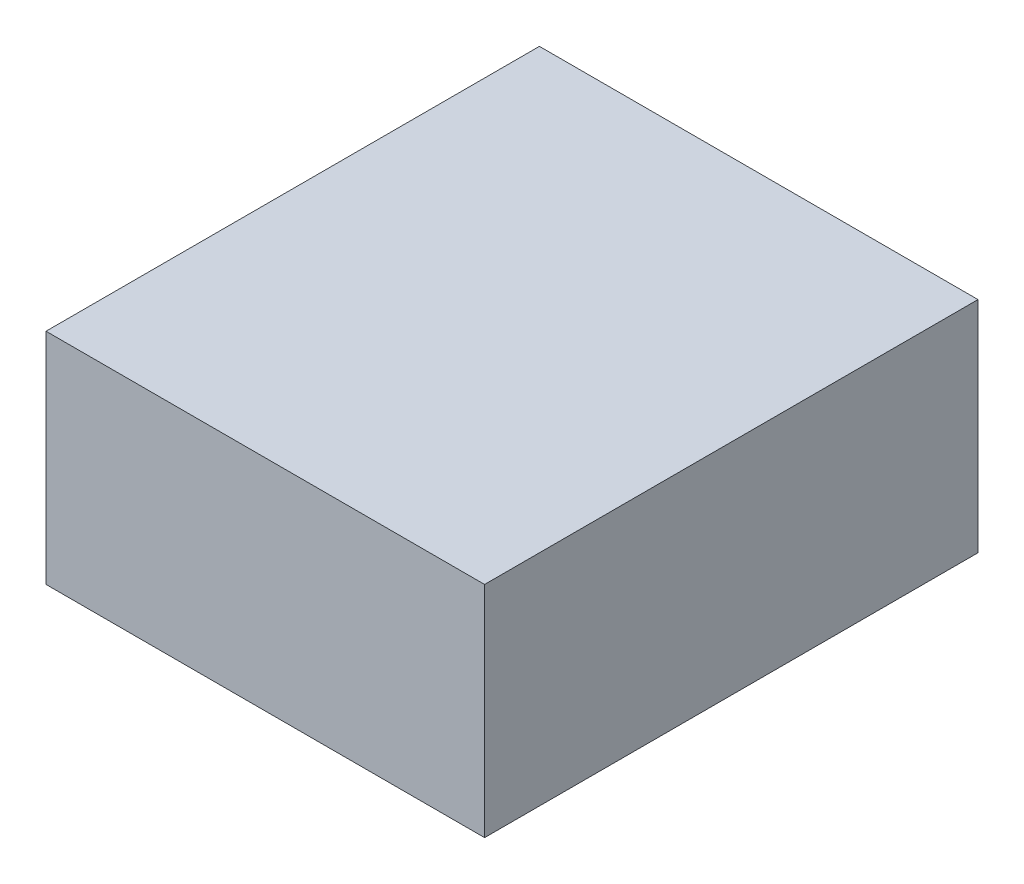
ISO-10303-21;
HEADER;
FILE_DESCRIPTION(('STEP AP214'),'2;1');
FILE_NAME('part.step','',(''),(''),'','','');
FILE_SCHEMA(('AUTOMOTIVE_DESIGN { 1 0 10303 214 1 1 1 1 }'));
ENDSEC;
DATA;
#1=APPLICATION_CONTEXT('core data for automotive mechanical design processes');
#2=APPLICATION_PROTOCOL_DEFINITION('international standard','automotive_design',2000,#1);
#3=PRODUCT_CONTEXT('',#1,'mechanical');
#4=PRODUCT('Part','Part','',(#3));
#5=PRODUCT_RELATED_PRODUCT_CATEGORY('part','',(#4));
#6=PRODUCT_DEFINITION_FORMATION('','',#4);
#7=PRODUCT_DEFINITION_CONTEXT('part definition',#1,'design');
#8=PRODUCT_DEFINITION('design','',#6,#7);
#9=PRODUCT_DEFINITION_SHAPE('','',#8);
#10=(LENGTH_UNIT() NAMED_UNIT(*) SI_UNIT(.MILLI.,.METRE.));
#11=(NAMED_UNIT(*) PLANE_ANGLE_UNIT() SI_UNIT($,.RADIAN.));
#12=(NAMED_UNIT(*) SI_UNIT($,.STERADIAN.) SOLID_ANGLE_UNIT());
#13=UNCERTAINTY_MEASURE_WITH_UNIT(LENGTH_MEASURE(1.E-05),#10,'distance_accuracy_value','');
#14=(GEOMETRIC_REPRESENTATION_CONTEXT(3) GLOBAL_UNCERTAINTY_ASSIGNED_CONTEXT((#13)) GLOBAL_UNIT_ASSIGNED_CONTEXT((#10,
#11,#12)) REPRESENTATION_CONTEXT('',''));
#15=CARTESIAN_POINT('',(0.,0.,0.));
#16=DIRECTION('',(0.,0.,1.));
#17=DIRECTION('',(1.,0.,0.));
#18=AXIS2_PLACEMENT_3D('',#15,#16,#17);
#19=CARTESIAN_POINT('',(0.3999992,0.1999996,0.));
#20=DIRECTION('',(0.,-1.,0.));
#21=DIRECTION('',(0.,0.,-1.));
#22=AXIS2_PLACEMENT_3D('',#19,#20,#21);
#23=PLANE('',#22);
#24=DIRECTION('',(0.,0.,-1.));
#25=VECTOR('',#24,1.);
#26=CARTESIAN_POINT('',(-0.3999992,0.1999996,0.));
#27=LINE('',#26,#25);
#28=CARTESIAN_POINT('',(-0.3999992,0.1999996,0.));
#29=VERTEX_POINT('',#28);
#30=CARTESIAN_POINT('',(-0.3999992,0.1999996,0.90000074));
#31=VERTEX_POINT('',#30);
#32=EDGE_CURVE('E20',#29,#31,#27,.F.);
#33=ORIENTED_EDGE('',*,*,#32,.T.);
#34=DIRECTION('',(-1.,0.,0.));
#35=VECTOR('',#34,1.);
#36=CARTESIAN_POINT('',(-0.3999992,0.1999996,0.90000074));
#37=LINE('',#36,#35);
#38=CARTESIAN_POINT('',(0.3999992,0.1999996,0.90000074));
#39=VERTEX_POINT('',#38);
#40=EDGE_CURVE('E55',#31,#39,#37,.F.);
#41=ORIENTED_EDGE('',*,*,#40,.T.);
#42=DIRECTION('',(0.,0.,1.));
#43=VECTOR('',#42,1.);
#44=CARTESIAN_POINT('',(0.3999992,0.1999996,0.));
#45=LINE('',#44,#43);
#46=CARTESIAN_POINT('',(0.3999992,0.1999996,0.));
#47=VERTEX_POINT('',#46);
#48=EDGE_CURVE('E76',#39,#47,#45,.F.);
#49=ORIENTED_EDGE('',*,*,#48,.T.);
#50=DIRECTION('',(-1.,0.,0.));
#51=VECTOR('',#50,1.);
#52=CARTESIAN_POINT('',(-0.3999992,0.1999996,0.));
#53=LINE('',#52,#51);
#54=EDGE_CURVE('E58',#29,#47,#53,.F.);
#55=ORIENTED_EDGE('',*,*,#54,.F.);
#56=EDGE_LOOP('',(#33,#41,#49,#55));
#57=FACE_BOUND('',#56,.T.);
#58=ADVANCED_FACE('F17',(#57),#23,.F.);
#59=CARTESIAN_POINT('',(-0.3999992,0.1999996,0.));
#60=DIRECTION('',(1.,0.,0.));
#61=DIRECTION('',(0.,0.,-1.));
#62=AXIS2_PLACEMENT_3D('',#59,#60,#61);
#63=PLANE('',#62);
#64=DIRECTION('',(0.,0.,1.));
#65=VECTOR('',#64,1.);
#66=CARTESIAN_POINT('',(-0.3999992,-0.1999996,0.));
#67=LINE('',#66,#65);
#68=CARTESIAN_POINT('',(-0.3999992,-0.1999996,0.));
#69=VERTEX_POINT('',#68);
#70=CARTESIAN_POINT('',(-0.3999992,-0.1999996,0.90000074));
#71=VERTEX_POINT('',#70);
#72=EDGE_CURVE('E73',#69,#71,#67,.T.);
#73=ORIENTED_EDGE('',*,*,#72,.T.);
#74=DIRECTION('',(0.,1.,0.));
#75=VECTOR('',#74,1.);
#76=CARTESIAN_POINT('',(-0.3999992,-0.1999996,0.90000074));
#77=LINE('',#76,#75);
#78=EDGE_CURVE('E63',#71,#31,#77,.T.);
#79=ORIENTED_EDGE('',*,*,#78,.T.);
#80=ORIENTED_EDGE('',*,*,#32,.F.);
#81=DIRECTION('',(0.,1.,0.));
#82=VECTOR('',#81,1.);
#83=CARTESIAN_POINT('',(-0.3999992,-0.1999996,0.));
#84=LINE('',#83,#82);
#85=EDGE_CURVE('E78',#69,#29,#84,.T.);
#86=ORIENTED_EDGE('',*,*,#85,.F.);
#87=EDGE_LOOP('',(#73,#79,#80,#86));
#88=FACE_BOUND('',#87,.T.);
#89=ADVANCED_FACE('F72',(#88),#63,.F.);
#90=CARTESIAN_POINT('',(-0.3999992,-0.1999996,0.90000074));
#91=DIRECTION('',(0.,0.,-1.));
#92=DIRECTION('',(-1.,0.,0.));
#93=AXIS2_PLACEMENT_3D('',#90,#91,#92);
#94=PLANE('',#93);
#95=DIRECTION('',(0.,1.,0.));
#96=VECTOR('',#95,1.);
#97=CARTESIAN_POINT('',(0.3999992,-0.1999996,0.90000074));
#98=LINE('',#97,#96);
#99=CARTESIAN_POINT('',(0.3999992,-0.1999996,0.90000074));
#100=VERTEX_POINT('',#99);
#101=EDGE_CURVE('E69',#100,#39,#98,.T.);
#102=ORIENTED_EDGE('',*,*,#101,.T.);
#103=ORIENTED_EDGE('',*,*,#40,.F.);
#104=ORIENTED_EDGE('',*,*,#78,.F.);
#105=DIRECTION('',(1.,0.,0.));
#106=VECTOR('',#105,1.);
#107=CARTESIAN_POINT('',(-0.3999992,-0.1999996,0.90000074));
#108=LINE('',#107,#106);
#109=EDGE_CURVE('E83',#71,#100,#108,.T.);
#110=ORIENTED_EDGE('',*,*,#109,.T.);
#111=EDGE_LOOP('',(#102,#103,#104,#110));
#112=FACE_BOUND('',#111,.T.);
#113=ADVANCED_FACE('F66',(#112),#94,.F.);
#114=CARTESIAN_POINT('',(0.3999992,-0.1999996,0.));
#115=DIRECTION('',(-1.,0.,0.));
#116=DIRECTION('',(0.,0.,1.));
#117=AXIS2_PLACEMENT_3D('',#114,#115,#116);
#118=PLANE('',#117);
#119=ORIENTED_EDGE('',*,*,#48,.F.);
#120=ORIENTED_EDGE('',*,*,#101,.F.);
#121=DIRECTION('',(0.,0.,1.));
#122=VECTOR('',#121,1.);
#123=CARTESIAN_POINT('',(0.3999992,-0.1999996,0.));
#124=LINE('',#123,#122);
#125=CARTESIAN_POINT('',(0.3999992,-0.1999996,0.));
#126=VERTEX_POINT('',#125);
#127=EDGE_CURVE('E26',#100,#126,#124,.F.);
#128=ORIENTED_EDGE('',*,*,#127,.T.);
#129=DIRECTION('',(0.,1.,0.));
#130=VECTOR('',#129,1.);
#131=CARTESIAN_POINT('',(0.3999992,-0.1999996,0.));
#132=LINE('',#131,#130);
#133=EDGE_CURVE('E34',#47,#126,#132,.F.);
#134=ORIENTED_EDGE('',*,*,#133,.F.);
#135=EDGE_LOOP('',(#119,#120,#128,#134));
#136=FACE_BOUND('',#135,.T.);
#137=ADVANCED_FACE('F88',(#136),#118,.F.);
#138=CARTESIAN_POINT('',(-0.3999992,-0.1999996,0.));
#139=DIRECTION('',(0.,0.,-1.));
#140=DIRECTION('',(-1.,0.,0.));
#141=AXIS2_PLACEMENT_3D('',#138,#139,#140);
#142=PLANE('',#141);
#143=ORIENTED_EDGE('',*,*,#133,.T.);
#144=DIRECTION('',(1.,0.,0.));
#145=VECTOR('',#144,1.);
#146=CARTESIAN_POINT('',(-0.3999992,-0.1999996,0.));
#147=LINE('',#146,#145);
#148=EDGE_CURVE('E11',#126,#69,#147,.F.);
#149=ORIENTED_EDGE('',*,*,#148,.T.);
#150=ORIENTED_EDGE('',*,*,#85,.T.);
#151=ORIENTED_EDGE('',*,*,#54,.T.);
#152=EDGE_LOOP('',(#143,#149,#150,#151));
#153=FACE_BOUND('',#152,.T.);
#154=ADVANCED_FACE('F91',(#153),#142,.T.);
#155=CARTESIAN_POINT('',(-0.3999992,-0.1999996,0.));
#156=DIRECTION('',(0.,1.,0.));
#157=DIRECTION('',(0.,0.,1.));
#158=AXIS2_PLACEMENT_3D('',#155,#156,#157);
#159=PLANE('',#158);
#160=ORIENTED_EDGE('',*,*,#127,.F.);
#161=ORIENTED_EDGE('',*,*,#109,.F.);
#162=ORIENTED_EDGE('',*,*,#72,.F.);
#163=ORIENTED_EDGE('',*,*,#148,.F.);
#164=EDGE_LOOP('',(#160,#161,#162,#163));
#165=FACE_BOUND('',#164,.T.);
#166=ADVANCED_FACE('F90',(#165),#159,.F.);
#167=CLOSED_SHELL('',(#58,#89,#113,#137,#154,#166));
#168=MANIFOLD_SOLID_BREP('B1',#167);
#169=ADVANCED_BREP_SHAPE_REPRESENTATION('',(#18,#168),#14);
#170=SHAPE_DEFINITION_REPRESENTATION(#9,#169);
ENDSEC;
END-ISO-10303-21;
